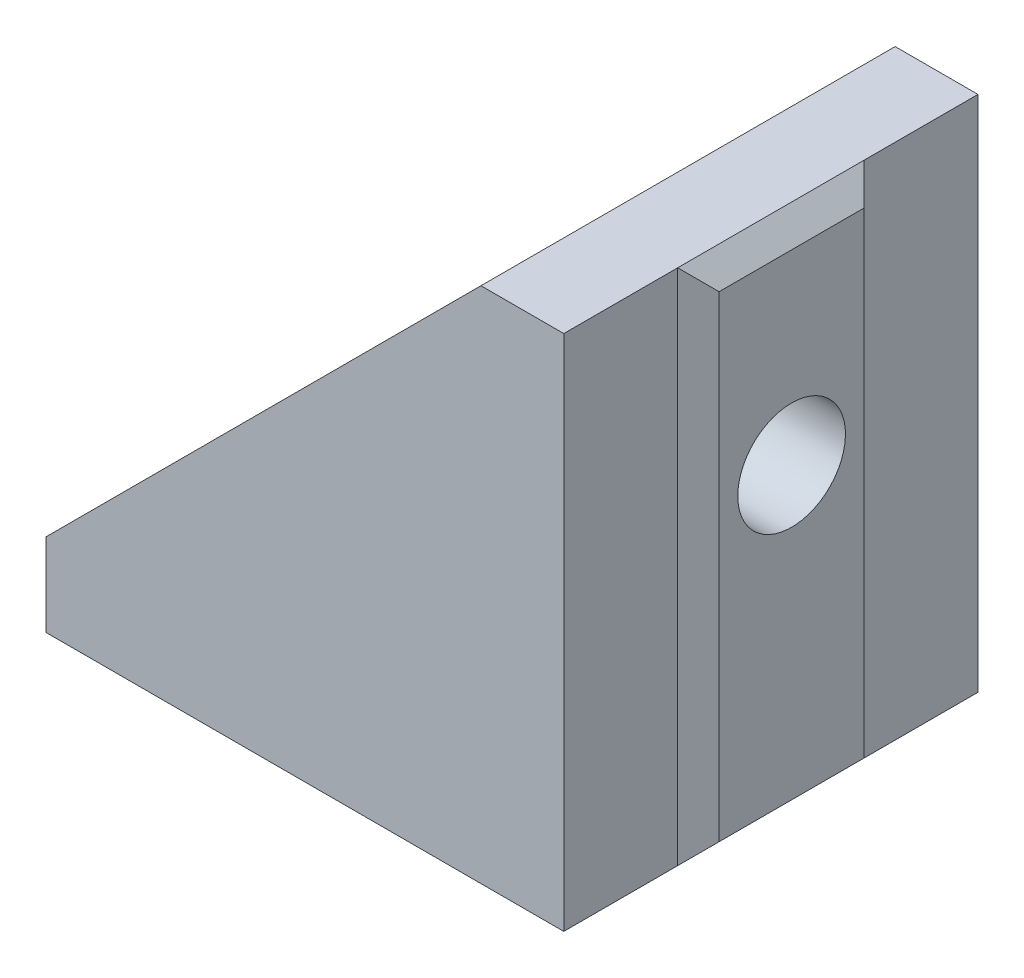
ISO-10303-21;
HEADER;
FILE_DESCRIPTION(('STEP AP214'),'2;1');
FILE_NAME('part.step','',(''),(''),'','','');
FILE_SCHEMA(('AUTOMOTIVE_DESIGN { 1 0 10303 214 1 1 1 1 }'));
ENDSEC;
DATA;
#1=APPLICATION_CONTEXT('core data for automotive mechanical design processes');
#2=APPLICATION_PROTOCOL_DEFINITION('international standard','automotive_design',2000,#1);
#3=PRODUCT_CONTEXT('',#1,'mechanical');
#4=PRODUCT('Part','Part','',(#3));
#5=PRODUCT_RELATED_PRODUCT_CATEGORY('part','',(#4));
#6=PRODUCT_DEFINITION_FORMATION('','',#4);
#7=PRODUCT_DEFINITION_CONTEXT('part definition',#1,'design');
#8=PRODUCT_DEFINITION('design','',#6,#7);
#9=PRODUCT_DEFINITION_SHAPE('','',#8);
#10=(LENGTH_UNIT() NAMED_UNIT(*) SI_UNIT(.MILLI.,.METRE.));
#11=(NAMED_UNIT(*) PLANE_ANGLE_UNIT() SI_UNIT($,.RADIAN.));
#12=(NAMED_UNIT(*) SI_UNIT($,.STERADIAN.) SOLID_ANGLE_UNIT());
#13=UNCERTAINTY_MEASURE_WITH_UNIT(LENGTH_MEASURE(1.E-05),#10,'distance_accuracy_value','');
#14=(GEOMETRIC_REPRESENTATION_CONTEXT(3) GLOBAL_UNCERTAINTY_ASSIGNED_CONTEXT((#13)) GLOBAL_UNIT_ASSIGNED_CONTEXT((#10,
#11,#12)) REPRESENTATION_CONTEXT('',''));
#15=CARTESIAN_POINT('',(0.,0.,0.));
#16=DIRECTION('',(0.,0.,1.));
#17=DIRECTION('',(1.,0.,0.));
#18=AXIS2_PLACEMENT_3D('',#15,#16,#17);
#19=CARTESIAN_POINT('',(25.0000000000001,0.,20.));
#20=DIRECTION('',(0.,1.,0.));
#21=DIRECTION('',(0.,0.,1.));
#22=AXIS2_PLACEMENT_3D('',#19,#20,#21);
#23=PLANE('',#22);
#24=DIRECTION('',(1.,0.,0.));
#25=VECTOR('',#24,1.);
#26=CARTESIAN_POINT('',(25.0000000000001,0.,5.5));
#27=LINE('',#26,#25);
#28=CARTESIAN_POINT('',(0.,0.,5.5));
#29=VERTEX_POINT('',#28);
#30=CARTESIAN_POINT('',(25.0000000000001,0.,5.5));
#31=VERTEX_POINT('',#30);
#32=EDGE_CURVE('E254',#29,#31,#27,.T.);
#33=ORIENTED_EDGE('',*,*,#32,.F.);
#34=DIRECTION('',(0.,0.,-1.));
#35=VECTOR('',#34,1.);
#36=CARTESIAN_POINT('',(0.,0.,20.));
#37=LINE('',#36,#35);
#38=CARTESIAN_POINT('',(0.,0.,0.));
#39=VERTEX_POINT('',#38);
#40=EDGE_CURVE('E321',#29,#39,#37,.T.);
#41=ORIENTED_EDGE('',*,*,#40,.T.);
#42=DIRECTION('',(1.,0.,0.));
#43=VECTOR('',#42,1.);
#44=CARTESIAN_POINT('',(25.0000000000001,0.,0.));
#45=LINE('',#44,#43);
#46=CARTESIAN_POINT('',(25.0000000000001,0.,0.));
#47=VERTEX_POINT('',#46);
#48=EDGE_CURVE('E291',#39,#47,#45,.T.);
#49=ORIENTED_EDGE('',*,*,#48,.T.);
#50=DIRECTION('',(0.,0.,-1.));
#51=VECTOR('',#50,1.);
#52=CARTESIAN_POINT('',(25.0000000000001,0.,20.));
#53=LINE('',#52,#51);
#54=EDGE_CURVE('E345',#31,#47,#53,.T.);
#55=ORIENTED_EDGE('',*,*,#54,.F.);
#56=EDGE_LOOP('',(#33,#41,#49,#55));
#57=FACE_BOUND('',#56,.T.);
#58=ADVANCED_FACE('F33',(#57),#23,.F.);
#59=DIRECTION('',(-1.,0.,0.));
#60=VECTOR('',#59,1.);
#61=CARTESIAN_POINT('',(25.0000000000001,0.,14.5));
#62=LINE('',#61,#60);
#63=CARTESIAN_POINT('',(25.0000000000001,0.,14.5));
#64=VERTEX_POINT('',#63);
#65=CARTESIAN_POINT('',(0.,0.,14.5));
#66=VERTEX_POINT('',#65);
#67=EDGE_CURVE('E238',#64,#66,#62,.T.);
#68=ORIENTED_EDGE('',*,*,#67,.F.);
#69=CARTESIAN_POINT('',(25.0000000000001,0.,20.));
#70=VERTEX_POINT('',#69);
#71=EDGE_CURVE('E346',#70,#64,#53,.T.);
#72=ORIENTED_EDGE('',*,*,#71,.F.);
#73=DIRECTION('',(1.,0.,0.));
#74=VECTOR('',#73,1.);
#75=CARTESIAN_POINT('',(25.0000000000001,0.,20.));
#76=LINE('',#75,#74);
#77=CARTESIAN_POINT('',(0.,0.,20.));
#78=VERTEX_POINT('',#77);
#79=EDGE_CURVE('E309',#78,#70,#76,.T.);
#80=ORIENTED_EDGE('',*,*,#79,.F.);
#81=EDGE_CURVE('E333',#78,#66,#37,.T.);
#82=ORIENTED_EDGE('',*,*,#81,.T.);
#83=EDGE_LOOP('',(#68,#72,#80,#82));
#84=FACE_BOUND('',#83,.T.);
#85=ADVANCED_FACE('F457',(#84),#23,.F.);
#86=CARTESIAN_POINT('',(25.0000000000001,25.,20.));
#87=DIRECTION('',(-1.,0.,0.));
#88=DIRECTION('',(0.,-1.,0.));
#89=AXIS2_PLACEMENT_3D('',#86,#87,#88);
#90=PLANE('',#89);
#91=DIRECTION('',(0.,-1.,0.));
#92=VECTOR('',#91,1.);
#93=CARTESIAN_POINT('',(25.0000000000001,25.,14.5));
#94=LINE('',#93,#92);
#95=CARTESIAN_POINT('',(25.0000000000001,25.,14.5));
#96=VERTEX_POINT('',#95);
#97=EDGE_CURVE('E261',#96,#64,#94,.T.);
#98=ORIENTED_EDGE('',*,*,#97,.F.);
#99=DIRECTION('',(0.,0.,-1.));
#100=VECTOR('',#99,1.);
#101=CARTESIAN_POINT('',(25.0000000000001,25.,20.));
#102=LINE('',#101,#100);
#103=CARTESIAN_POINT('',(25.0000000000001,25.,20.));
#104=VERTEX_POINT('',#103);
#105=EDGE_CURVE('E342',#104,#96,#102,.T.);
#106=ORIENTED_EDGE('',*,*,#105,.F.);
#107=DIRECTION('',(0.,1.,0.));
#108=VECTOR('',#107,1.);
#109=CARTESIAN_POINT('',(25.0000000000001,25.,20.));
#110=LINE('',#109,#108);
#111=EDGE_CURVE('E312',#70,#104,#110,.T.);
#112=ORIENTED_EDGE('',*,*,#111,.F.);
#113=ORIENTED_EDGE('',*,*,#71,.T.);
#114=EDGE_LOOP('',(#98,#106,#112,#113));
#115=FACE_BOUND('',#114,.T.);
#116=ADVANCED_FACE('F455',(#115),#90,.F.);
#117=DIRECTION('',(0.,1.,0.));
#118=VECTOR('',#117,1.);
#119=CARTESIAN_POINT('',(25.0000000000001,25.,5.5));
#120=LINE('',#119,#118);
#121=CARTESIAN_POINT('',(25.0000000000001,25.,5.5));
#122=VERTEX_POINT('',#121);
#123=EDGE_CURVE('E281',#31,#122,#120,.T.);
#124=ORIENTED_EDGE('',*,*,#123,.F.);
#125=ORIENTED_EDGE('',*,*,#54,.T.);
#126=DIRECTION('',(0.,1.,0.));
#127=VECTOR('',#126,1.);
#128=CARTESIAN_POINT('',(25.0000000000001,25.,0.));
#129=LINE('',#128,#127);
#130=CARTESIAN_POINT('',(25.0000000000001,25.,0.));
#131=VERTEX_POINT('',#130);
#132=EDGE_CURVE('E324',#47,#131,#129,.T.);
#133=ORIENTED_EDGE('',*,*,#132,.T.);
#134=EDGE_CURVE('E341',#122,#131,#102,.T.);
#135=ORIENTED_EDGE('',*,*,#134,.F.);
#136=EDGE_LOOP('',(#124,#125,#133,#135));
#137=FACE_BOUND('',#136,.T.);
#138=ADVANCED_FACE('F436',(#137),#90,.F.);
#139=CARTESIAN_POINT('',(21.0000000000001,25.,20.));
#140=DIRECTION('',(0.,-1.,0.));
#141=DIRECTION('',(0.,0.,-1.));
#142=AXIS2_PLACEMENT_3D('',#139,#140,#141);
#143=PLANE('',#142);
#144=DIRECTION('',(-1.,0.,0.));
#145=VECTOR('',#144,1.);
#146=CARTESIAN_POINT('',(21.0000000000001,25.,0.));
#147=LINE('',#146,#145);
#148=CARTESIAN_POINT('',(21.0000000000001,25.,0.));
#149=VERTEX_POINT('',#148);
#150=EDGE_CURVE('E327',#131,#149,#147,.T.);
#151=ORIENTED_EDGE('',*,*,#150,.T.);
#152=DIRECTION('',(0.,0.,-1.));
#153=VECTOR('',#152,1.);
#154=CARTESIAN_POINT('',(21.0000000000001,25.,20.));
#155=LINE('',#154,#153);
#156=CARTESIAN_POINT('',(21.0000000000001,25.,20.));
#157=VERTEX_POINT('',#156);
#158=EDGE_CURVE('E338',#157,#149,#155,.T.);
#159=ORIENTED_EDGE('',*,*,#158,.F.);
#160=DIRECTION('',(-1.,0.,0.));
#161=VECTOR('',#160,1.);
#162=CARTESIAN_POINT('',(21.0000000000001,25.,20.));
#163=LINE('',#162,#161);
#164=EDGE_CURVE('E315',#104,#157,#163,.T.);
#165=ORIENTED_EDGE('',*,*,#164,.F.);
#166=ORIENTED_EDGE('',*,*,#105,.T.);
#167=DIRECTION('',(0.,0.,1.));
#168=VECTOR('',#167,1.);
#169=CARTESIAN_POINT('',(25.0000000000001,25.,14.5));
#170=LINE('',#169,#168);
#171=EDGE_CURVE('E284',#122,#96,#170,.T.);
#172=ORIENTED_EDGE('',*,*,#171,.F.);
#173=ORIENTED_EDGE('',*,*,#134,.T.);
#174=EDGE_LOOP('',(#151,#159,#165,#166,#172,#173));
#175=FACE_BOUND('',#174,.T.);
#176=ADVANCED_FACE('F432',(#175),#143,.F.);
#177=CARTESIAN_POINT('',(0.,4.,20.));
#178=DIRECTION('',(0.707106781186546,-0.707106781186549,0.));
#179=DIRECTION('',(0.707106781186549,0.707106781186546,0.));
#180=AXIS2_PLACEMENT_3D('',#177,#178,#179);
#181=PLANE('',#180);
#182=DIRECTION('',(0.,0.,1.));
#183=VECTOR('',#182,1.);
#184=CARTESIAN_POINT('',(2.4738023329125,6.47380233291249,7.50000000000002));
#185=LINE('',#184,#183);
#186=CARTESIAN_POINT('',(2.4738023329125,6.47380233291249,7.50000000000002));
#187=VERTEX_POINT('',#186);
#188=CARTESIAN_POINT('',(2.4738023329125,6.47380233291249,12.5));
#189=VERTEX_POINT('',#188);
#190=EDGE_CURVE('E222',#187,#189,#185,.T.);
#191=ORIENTED_EDGE('',*,*,#190,.F.);
#192=CARTESIAN_POINT('',(4.24156928587887,8.24156928587886,7.5));
#193=DIRECTION('',(-0.707106781186546,0.707106781186549,0.));
#194=DIRECTION('',(-0.707106781186549,-0.707106781186546,0.));
#195=AXIS2_PLACEMENT_3D('',#192,#193,#194);
#196=CIRCLE('',#195,2.5);
#197=CARTESIAN_POINT('',(4.24156928587888,8.24156928587887,5.));
#198=VERTEX_POINT('',#197);
#199=EDGE_CURVE('E203',#198,#187,#196,.T.);
#200=ORIENTED_EDGE('',*,*,#199,.F.);
#201=DIRECTION('',(-0.707106781186549,-0.707106781186546,0.));
#202=VECTOR('',#201,1.);
#203=CARTESIAN_POINT('',(16.7573593128808,20.7573593128807,5.));
#204=LINE('',#203,#202);
#205=CARTESIAN_POINT('',(16.7573593128808,20.7573593128807,5.));
#206=VERTEX_POINT('',#205);
#207=EDGE_CURVE('E212',#206,#198,#204,.T.);
#208=ORIENTED_EDGE('',*,*,#207,.F.);
#209=CARTESIAN_POINT('',(16.7573593128808,20.7573593128807,7.5));
#210=DIRECTION('',(-0.707106781186546,0.707106781186549,0.));
#211=DIRECTION('',(0.707106781186549,0.707106781186546,0.));
#212=AXIS2_PLACEMENT_3D('',#209,#210,#211);
#213=CIRCLE('',#212,2.5);
#214=CARTESIAN_POINT('',(18.5251262658472,22.5251262658471,7.5));
#215=VERTEX_POINT('',#214);
#216=EDGE_CURVE('E216',#215,#206,#213,.T.);
#217=ORIENTED_EDGE('',*,*,#216,.F.);
#218=DIRECTION('',(0.,0.,-1.));
#219=VECTOR('',#218,1.);
#220=CARTESIAN_POINT('',(18.5251262658472,22.5251262658471,7.50000000000002));
#221=LINE('',#220,#219);
#222=CARTESIAN_POINT('',(18.5251262658472,22.5251262658471,12.5));
#223=VERTEX_POINT('',#222);
#224=EDGE_CURVE('E232',#223,#215,#221,.T.);
#225=ORIENTED_EDGE('',*,*,#224,.F.);
#226=CARTESIAN_POINT('',(16.7573593128808,20.7573593128807,12.5));
#227=DIRECTION('',(-0.707106781186546,0.707106781186549,0.));
#228=DIRECTION('',(-0.707106781186549,-0.707106781186546,0.));
#229=AXIS2_PLACEMENT_3D('',#226,#227,#228);
#230=CIRCLE('',#229,2.5);
#231=CARTESIAN_POINT('',(16.7573593128808,20.7573593128807,15.));
#232=VERTEX_POINT('',#231);
#233=EDGE_CURVE('E229',#232,#223,#230,.T.);
#234=ORIENTED_EDGE('',*,*,#233,.F.);
#235=DIRECTION('',(0.707106781186549,0.707106781186546,0.));
#236=VECTOR('',#235,1.);
#237=CARTESIAN_POINT('',(16.7573593128808,20.7573593128807,15.));
#238=LINE('',#237,#236);
#239=CARTESIAN_POINT('',(4.24156928587888,8.24156928587887,15.));
#240=VERTEX_POINT('',#239);
#241=EDGE_CURVE('E227',#240,#232,#238,.T.);
#242=ORIENTED_EDGE('',*,*,#241,.F.);
#243=CARTESIAN_POINT('',(4.24156928587887,8.24156928587886,12.5));
#244=DIRECTION('',(-0.707106781186546,0.707106781186549,0.));
#245=DIRECTION('',(-0.707106781186549,-0.707106781186546,0.));
#246=AXIS2_PLACEMENT_3D('',#243,#244,#245);
#247=CIRCLE('',#246,2.5);
#248=EDGE_CURVE('E224',#189,#240,#247,.T.);
#249=ORIENTED_EDGE('',*,*,#248,.F.);
#250=EDGE_LOOP('',(#191,#200,#208,#217,#225,#234,#242,#249));
#251=FACE_BOUND('',#250,.T.);
#252=DIRECTION('',(-0.707106781186549,-0.707106781186546,0.));
#253=VECTOR('',#252,1.);
#254=CARTESIAN_POINT('',(0.,4.,0.));
#255=LINE('',#254,#253);
#256=CARTESIAN_POINT('',(0.,4.,0.));
#257=VERTEX_POINT('',#256);
#258=EDGE_CURVE('E329',#149,#257,#255,.T.);
#259=ORIENTED_EDGE('',*,*,#258,.T.);
#260=DIRECTION('',(0.,0.,-1.));
#261=VECTOR('',#260,1.);
#262=CARTESIAN_POINT('',(0.,4.,20.));
#263=LINE('',#262,#261);
#264=CARTESIAN_POINT('',(0.,4.,20.));
#265=VERTEX_POINT('',#264);
#266=EDGE_CURVE('E335',#265,#257,#263,.T.);
#267=ORIENTED_EDGE('',*,*,#266,.F.);
#268=DIRECTION('',(-0.707106781186549,-0.707106781186546,0.));
#269=VECTOR('',#268,1.);
#270=CARTESIAN_POINT('',(0.,4.,20.));
#271=LINE('',#270,#269);
#272=EDGE_CURVE('E317',#157,#265,#271,.T.);
#273=ORIENTED_EDGE('',*,*,#272,.F.);
#274=ORIENTED_EDGE('',*,*,#158,.T.);
#275=EDGE_LOOP('',(#259,#267,#273,#274));
#276=FACE_BOUND('',#275,.T.);
#277=ADVANCED_FACE('F380',(#251,#276),#181,.F.);
#278=CARTESIAN_POINT('',(0.,0.,20.));
#279=DIRECTION('',(1.,0.,0.));
#280=DIRECTION('',(0.,0.,-1.));
#281=AXIS2_PLACEMENT_3D('',#278,#279,#280);
#282=PLANE('',#281);
#283=DIRECTION('',(0.,-1.,0.));
#284=VECTOR('',#283,1.);
#285=CARTESIAN_POINT('',(0.,0.,0.));
#286=LINE('',#285,#284);
#287=EDGE_CURVE('E313',#257,#39,#286,.T.);
#288=ORIENTED_EDGE('',*,*,#287,.T.);
#289=ORIENTED_EDGE('',*,*,#40,.F.);
#290=DIRECTION('',(0.,0.,-1.));
#291=VECTOR('',#290,1.);
#292=CARTESIAN_POINT('',(0.,0.,14.5));
#293=LINE('',#292,#291);
#294=EDGE_CURVE('E251',#66,#29,#293,.T.);
#295=ORIENTED_EDGE('',*,*,#294,.F.);
#296=ORIENTED_EDGE('',*,*,#81,.F.);
#297=DIRECTION('',(0.,-1.,0.));
#298=VECTOR('',#297,1.);
#299=CARTESIAN_POINT('',(0.,0.,20.));
#300=LINE('',#299,#298);
#301=EDGE_CURVE('E319',#265,#78,#300,.T.);
#302=ORIENTED_EDGE('',*,*,#301,.F.);
#303=ORIENTED_EDGE('',*,*,#266,.T.);
#304=EDGE_LOOP('',(#288,#289,#295,#296,#302,#303));
#305=FACE_BOUND('',#304,.T.);
#306=ADVANCED_FACE('F473',(#305),#282,.F.);
#307=CARTESIAN_POINT('',(0.,0.,20.));
#308=DIRECTION('',(0.,0.,-1.));
#309=DIRECTION('',(-1.,0.,0.));
#310=AXIS2_PLACEMENT_3D('',#307,#308,#309);
#311=PLANE('',#310);
#312=ORIENTED_EDGE('',*,*,#79,.T.);
#313=ORIENTED_EDGE('',*,*,#111,.T.);
#314=ORIENTED_EDGE('',*,*,#164,.T.);
#315=ORIENTED_EDGE('',*,*,#272,.T.);
#316=ORIENTED_EDGE('',*,*,#301,.T.);
#317=EDGE_LOOP('',(#312,#313,#314,#315,#316));
#318=FACE_BOUND('',#317,.T.);
#319=ADVANCED_FACE('F450',(#318),#311,.F.);
#320=CARTESIAN_POINT('',(0.,0.,0.));
#321=DIRECTION('',(0.,0.,-1.));
#322=DIRECTION('',(-1.,0.,0.));
#323=AXIS2_PLACEMENT_3D('',#320,#321,#322);
#324=PLANE('',#323);
#325=ORIENTED_EDGE('',*,*,#48,.F.);
#326=ORIENTED_EDGE('',*,*,#287,.F.);
#327=ORIENTED_EDGE('',*,*,#258,.F.);
#328=ORIENTED_EDGE('',*,*,#150,.F.);
#329=ORIENTED_EDGE('',*,*,#132,.F.);
#330=EDGE_LOOP('',(#325,#326,#327,#328,#329));
#331=FACE_BOUND('',#330,.T.);
#332=ADVANCED_FACE('F443',(#331),#324,.T.);
#333=CARTESIAN_POINT('',(25.0000000000001,25.,14.5));
#334=DIRECTION('',(0.707106781186549,0.,0.707106781186546));
#335=DIRECTION('',(0.707106781186546,0.,-0.707106781186549));
#336=AXIS2_PLACEMENT_3D('',#333,#334,#335);
#337=PLANE('',#336);
#338=ORIENTED_EDGE('',*,*,#97,.T.);
#339=DIRECTION('',(-0.577350269189624,-0.577350269189627,0.577350269189626));
#340=VECTOR('',#339,1.);
#341=CARTESIAN_POINT('',(25.0000000000001,0.,14.5));
#342=LINE('',#341,#340);
#343=CARTESIAN_POINT('',(26.0000000000001,1.00000000000001,13.5));
#344=VERTEX_POINT('',#343);
#345=EDGE_CURVE('E288',#344,#64,#342,.T.);
#346=ORIENTED_EDGE('',*,*,#345,.F.);
#347=DIRECTION('',(0.,1.,0.));
#348=VECTOR('',#347,1.);
#349=CARTESIAN_POINT('',(26.0000000000001,25.,13.5));
#350=LINE('',#349,#348);
#351=CARTESIAN_POINT('',(26.0000000000001,24.,13.5));
#352=VERTEX_POINT('',#351);
#353=EDGE_CURVE('E287',#352,#344,#350,.F.);
#354=ORIENTED_EDGE('',*,*,#353,.F.);
#355=DIRECTION('',(-0.577350269189625,0.577350269189626,0.577350269189627));
#356=VECTOR('',#355,1.);
#357=CARTESIAN_POINT('',(25.0000000000001,25.,14.5));
#358=LINE('',#357,#356);
#359=EDGE_CURVE('E293',#352,#96,#358,.T.);
#360=ORIENTED_EDGE('',*,*,#359,.T.);
#361=EDGE_LOOP('',(#338,#346,#354,#360));
#362=FACE_BOUND('',#361,.T.);
#363=ADVANCED_FACE('F419',(#362),#337,.T.);
#364=CARTESIAN_POINT('',(25.0000000000001,0.,14.5));
#365=DIRECTION('',(0.707106781186549,-0.707106781186546,0.));
#366=DIRECTION('',(0.707106781186546,0.707106781186549,0.));
#367=AXIS2_PLACEMENT_3D('',#364,#365,#366);
#368=PLANE('',#367);
#369=ORIENTED_EDGE('',*,*,#345,.T.);
#370=DIRECTION('',(0.577350269189626,0.577350269189624,0.577350269189627));
#371=VECTOR('',#370,1.);
#372=CARTESIAN_POINT('',(25.0000000000001,0.,14.5));
#373=LINE('',#372,#371);
#374=CARTESIAN_POINT('',(24.0000000000001,-1.,13.5));
#375=VERTEX_POINT('',#374);
#376=EDGE_CURVE('E258',#375,#64,#373,.T.);
#377=ORIENTED_EDGE('',*,*,#376,.F.);
#378=DIRECTION('',(0.,0.,-1.));
#379=VECTOR('',#378,1.);
#380=CARTESIAN_POINT('',(24.0000000000001,-1.,0.));
#381=LINE('',#380,#379);
#382=CARTESIAN_POINT('',(24.0000000000001,-1.,6.5));
#383=VERTEX_POINT('',#382);
#384=EDGE_CURVE('E257',#383,#375,#381,.F.);
#385=ORIENTED_EDGE('',*,*,#384,.F.);
#386=DIRECTION('',(0.577350269189626,0.577350269189624,-0.577350269189627));
#387=VECTOR('',#386,1.);
#388=CARTESIAN_POINT('',(22.0000000000001,-3.,8.50000000000001));
#389=LINE('',#388,#387);
#390=EDGE_CURVE('E263',#383,#31,#389,.T.);
#391=ORIENTED_EDGE('',*,*,#390,.T.);
#392=DIRECTION('',(-0.577350269189624,-0.577350269189627,-0.577350269189627));
#393=VECTOR('',#392,1.);
#394=CARTESIAN_POINT('',(33.3333333333334,8.33333333333336,13.8333333333334));
#395=LINE('',#394,#393);
#396=CARTESIAN_POINT('',(26.0000000000001,1.00000000000001,6.5));
#397=VERTEX_POINT('',#396);
#398=EDGE_CURVE('E292',#397,#31,#395,.T.);
#399=ORIENTED_EDGE('',*,*,#398,.F.);
#400=DIRECTION('',(0.,0.,1.));
#401=VECTOR('',#400,1.);
#402=CARTESIAN_POINT('',(26.0000000000001,1.00000000000001,14.5));
#403=LINE('',#402,#401);
#404=EDGE_CURVE('E304',#344,#397,#403,.F.);
#405=ORIENTED_EDGE('',*,*,#404,.F.);
#406=EDGE_LOOP('',(#369,#377,#385,#391,#399,#405));
#407=FACE_BOUND('',#406,.T.);
#408=ADVANCED_FACE('F422',(#407),#368,.T.);
#409=CARTESIAN_POINT('',(25.0000000000001,25.,5.5));
#410=DIRECTION('',(0.707106781186549,0.,-0.707106781186546));
#411=DIRECTION('',(-0.707106781186546,0.,-0.707106781186549));
#412=AXIS2_PLACEMENT_3D('',#409,#410,#411);
#413=PLANE('',#412);
#414=ORIENTED_EDGE('',*,*,#123,.T.);
#415=DIRECTION('',(-0.577350269189625,0.577350269189626,-0.577350269189627));
#416=VECTOR('',#415,1.);
#417=CARTESIAN_POINT('',(28.0000000000001,22.,8.50000000000001));
#418=LINE('',#417,#416);
#419=CARTESIAN_POINT('',(26.0000000000001,24.,6.50000000000001));
#420=VERTEX_POINT('',#419);
#421=EDGE_CURVE('E296',#420,#122,#418,.T.);
#422=ORIENTED_EDGE('',*,*,#421,.F.);
#423=DIRECTION('',(0.,-1.,0.));
#424=VECTOR('',#423,1.);
#425=CARTESIAN_POINT('',(26.0000000000001,25.,6.50000000000001));
#426=LINE('',#425,#424);
#427=EDGE_CURVE('E306',#397,#420,#426,.F.);
#428=ORIENTED_EDGE('',*,*,#427,.F.);
#429=ORIENTED_EDGE('',*,*,#398,.T.);
#430=EDGE_LOOP('',(#414,#422,#428,#429));
#431=FACE_BOUND('',#430,.T.);
#432=ADVANCED_FACE('F428',(#431),#413,.T.);
#433=CARTESIAN_POINT('',(25.0000000000001,25.,14.5));
#434=DIRECTION('',(0.707106781186548,0.707106781186547,0.));
#435=DIRECTION('',(-0.707106781186547,0.707106781186548,0.));
#436=AXIS2_PLACEMENT_3D('',#433,#434,#435);
#437=PLANE('',#436);
#438=ORIENTED_EDGE('',*,*,#171,.T.);
#439=ORIENTED_EDGE('',*,*,#359,.F.);
#440=DIRECTION('',(0.,0.,-1.));
#441=VECTOR('',#440,1.);
#442=CARTESIAN_POINT('',(26.0000000000001,24.,14.5));
#443=LINE('',#442,#441);
#444=EDGE_CURVE('E297',#420,#352,#443,.F.);
#445=ORIENTED_EDGE('',*,*,#444,.F.);
#446=ORIENTED_EDGE('',*,*,#421,.T.);
#447=EDGE_LOOP('',(#438,#439,#445,#446));
#448=FACE_BOUND('',#447,.T.);
#449=ADVANCED_FACE('F411',(#448),#437,.T.);
#450=CARTESIAN_POINT('',(26.0000000000001,0.,0.));
#451=DIRECTION('',(1.,0.,0.));
#452=DIRECTION('',(0.,1.,0.));
#453=AXIS2_PLACEMENT_3D('',#450,#451,#452);
#454=PLANE('',#453);
#455=CARTESIAN_POINT('',(26.0000000000001,15.,10.));
#456=DIRECTION('',(1.,0.,0.));
#457=DIRECTION('',(0.,1.,0.));
#458=AXIS2_PLACEMENT_3D('',#455,#456,#457);
#459=CIRCLE('',#458,2.6);
#460=CARTESIAN_POINT('',(26.0000000000001,17.6,10.));
#461=VERTEX_POINT('',#460);
#462=EDGE_CURVE('E397',#461,#461,#459,.T.);
#463=ORIENTED_EDGE('',*,*,#462,.F.);
#464=EDGE_LOOP('',(#463));
#465=FACE_BOUND('',#464,.T.);
#466=ORIENTED_EDGE('',*,*,#353,.T.);
#467=ORIENTED_EDGE('',*,*,#404,.T.);
#468=ORIENTED_EDGE('',*,*,#427,.T.);
#469=ORIENTED_EDGE('',*,*,#444,.T.);
#470=EDGE_LOOP('',(#466,#467,#468,#469));
#471=FACE_BOUND('',#470,.T.);
#472=ADVANCED_FACE('F407',(#465,#471),#454,.T.);
#473=CARTESIAN_POINT('',(25.0000000000001,0.,14.5));
#474=DIRECTION('',(0.,-0.707106781186549,0.707106781186546));
#475=DIRECTION('',(0.,-0.707106781186546,-0.707106781186549));
#476=AXIS2_PLACEMENT_3D('',#473,#474,#475);
#477=PLANE('',#476);
#478=ORIENTED_EDGE('',*,*,#67,.T.);
#479=DIRECTION('',(-0.577350269189626,0.577350269189624,0.577350269189627));
#480=VECTOR('',#479,1.);
#481=CARTESIAN_POINT('',(0.,0.,14.5));
#482=LINE('',#481,#480);
#483=CARTESIAN_POINT('',(1.,-1.,13.5));
#484=VERTEX_POINT('',#483);
#485=EDGE_CURVE('E262',#484,#66,#482,.T.);
#486=ORIENTED_EDGE('',*,*,#485,.F.);
#487=DIRECTION('',(1.,0.,0.));
#488=VECTOR('',#487,1.);
#489=CARTESIAN_POINT('',(0.,-1.,13.5));
#490=LINE('',#489,#488);
#491=EDGE_CURVE('E274',#375,#484,#490,.F.);
#492=ORIENTED_EDGE('',*,*,#491,.F.);
#493=ORIENTED_EDGE('',*,*,#376,.T.);
#494=EDGE_LOOP('',(#478,#486,#492,#493));
#495=FACE_BOUND('',#494,.T.);
#496=ADVANCED_FACE('F410',(#495),#477,.T.);
#497=CARTESIAN_POINT('',(0.,0.,14.5));
#498=DIRECTION('',(-0.707106781186546,-0.707106781186549,0.));
#499=DIRECTION('',(0.707106781186549,-0.707106781186546,0.));
#500=AXIS2_PLACEMENT_3D('',#497,#498,#499);
#501=PLANE('',#500);
#502=ORIENTED_EDGE('',*,*,#294,.T.);
#503=DIRECTION('',(-0.577350269189626,0.577350269189624,-0.577350269189627));
#504=VECTOR('',#503,1.);
#505=CARTESIAN_POINT('',(8.33333333333338,-8.33333333333335,13.8333333333334));
#506=LINE('',#505,#504);
#507=CARTESIAN_POINT('',(1.,-1.,6.5));
#508=VERTEX_POINT('',#507);
#509=EDGE_CURVE('E266',#508,#29,#506,.T.);
#510=ORIENTED_EDGE('',*,*,#509,.F.);
#511=DIRECTION('',(0.,0.,1.));
#512=VECTOR('',#511,1.);
#513=CARTESIAN_POINT('',(1.,-1.,0.));
#514=LINE('',#513,#512);
#515=EDGE_CURVE('E276',#484,#508,#514,.F.);
#516=ORIENTED_EDGE('',*,*,#515,.F.);
#517=ORIENTED_EDGE('',*,*,#485,.T.);
#518=EDGE_LOOP('',(#502,#510,#516,#517));
#519=FACE_BOUND('',#518,.T.);
#520=ADVANCED_FACE('F463',(#519),#501,.T.);
#521=CARTESIAN_POINT('',(25.0000000000001,0.,5.5));
#522=DIRECTION('',(0.,-0.707106781186549,-0.707106781186546));
#523=DIRECTION('',(0.,0.707106781186546,-0.707106781186549));
#524=AXIS2_PLACEMENT_3D('',#521,#522,#523);
#525=PLANE('',#524);
#526=ORIENTED_EDGE('',*,*,#32,.T.);
#527=ORIENTED_EDGE('',*,*,#390,.F.);
#528=DIRECTION('',(-1.,0.,0.));
#529=VECTOR('',#528,1.);
#530=CARTESIAN_POINT('',(0.,-1.,6.5));
#531=LINE('',#530,#529);
#532=EDGE_CURVE('E267',#508,#383,#531,.F.);
#533=ORIENTED_EDGE('',*,*,#532,.F.);
#534=ORIENTED_EDGE('',*,*,#509,.T.);
#535=EDGE_LOOP('',(#526,#527,#533,#534));
#536=FACE_BOUND('',#535,.T.);
#537=ADVANCED_FACE('F469',(#536),#525,.T.);
#538=CARTESIAN_POINT('',(0.,-1.,0.));
#539=DIRECTION('',(0.,1.,0.));
#540=DIRECTION('',(0.,0.,1.));
#541=AXIS2_PLACEMENT_3D('',#538,#539,#540);
#542=PLANE('',#541);
#543=CARTESIAN_POINT('',(9.,-1.,9.99999999999999));
#544=DIRECTION('',(0.,-1.,0.));
#545=DIRECTION('',(0.,0.,-1.));
#546=AXIS2_PLACEMENT_3D('',#543,#544,#545);
#547=CIRCLE('',#546,2.6);
#548=CARTESIAN_POINT('',(9.,-1.,7.4));
#549=VERTEX_POINT('',#548);
#550=EDGE_CURVE('E391',#549,#549,#547,.T.);
#551=ORIENTED_EDGE('',*,*,#550,.F.);
#552=EDGE_LOOP('',(#551));
#553=FACE_BOUND('',#552,.T.);
#554=ORIENTED_EDGE('',*,*,#384,.T.);
#555=ORIENTED_EDGE('',*,*,#491,.T.);
#556=ORIENTED_EDGE('',*,*,#515,.T.);
#557=ORIENTED_EDGE('',*,*,#532,.T.);
#558=EDGE_LOOP('',(#554,#555,#556,#557));
#559=FACE_BOUND('',#558,.T.);
#560=ADVANCED_FACE('F467',(#553,#559),#542,.F.);
#561=CARTESIAN_POINT('',(6.71644302003178,5.76669555172594,7.5));
#562=DIRECTION('',(-0.707106781186546,0.707106781186549,0.));
#563=DIRECTION('',(-0.707106781186549,-0.707106781186546,0.));
#564=AXIS2_PLACEMENT_3D('',#561,#562,#563);
#565=CYLINDRICAL_SURFACE('',#564,2.5);
#566=ORIENTED_EDGE('',*,*,#199,.T.);
#567=DIRECTION('',(-0.707106781186546,0.707106781186549,0.));
#568=VECTOR('',#567,1.);
#569=CARTESIAN_POINT('',(4.94867606706541,3.99892859875957,7.50000000000002));
#570=LINE('',#569,#568);
#571=CARTESIAN_POINT('',(4.94867606706541,3.99892859875957,7.50000000000002));
#572=VERTEX_POINT('',#571);
#573=EDGE_CURVE('E200',#572,#187,#570,.T.);
#574=ORIENTED_EDGE('',*,*,#573,.F.);
#575=CARTESIAN_POINT('',(8.4842099729982,3.99892859875951,7.5));
#576=DIRECTION('',(0.,1.,0.));
#577=DIRECTION('',(-1.,0.,0.));
#578=AXIS2_PLACEMENT_3D('',#575,#576,#577);
#579=ELLIPSE('',#578,3.53553390593276,2.5);
#580=CARTESIAN_POINT('',(8.48420997299823,3.99892859875951,5.));
#581=VERTEX_POINT('',#580);
#582=EDGE_CURVE('E188',#572,#581,#579,.F.);
#583=ORIENTED_EDGE('',*,*,#582,.T.);
#584=DIRECTION('',(-0.707106781186546,0.707106781186549,0.));
#585=VECTOR('',#584,1.);
#586=CARTESIAN_POINT('',(6.71644302003179,5.76669555172595,5.));
#587=LINE('',#586,#585);
#588=EDGE_CURVE('E73',#581,#198,#587,.T.);
#589=ORIENTED_EDGE('',*,*,#588,.T.);
#590=EDGE_LOOP('',(#566,#574,#583,#589));
#591=FACE_BOUND('',#590,.T.);
#592=ADVANCED_FACE('F201',(#591),#565,.F.);
#593=CARTESIAN_POINT('',(19.2322330470337,18.2824855787278,5.));
#594=DIRECTION('',(0.,0.,-1.));
#595=DIRECTION('',(-1.,0.,0.));
#596=AXIS2_PLACEMENT_3D('',#593,#594,#595);
#597=PLANE('',#596);
#598=ORIENTED_EDGE('',*,*,#207,.T.);
#599=ORIENTED_EDGE('',*,*,#588,.F.);
#600=DIRECTION('',(1.,0.,0.));
#601=VECTOR('',#600,1.);
#602=CARTESIAN_POINT('',(19.2322330470336,3.99892859875944,5.));
#603=LINE('',#602,#601);
#604=CARTESIAN_POINT('',(14.848171003677,3.99892859875947,5.));
#605=VERTEX_POINT('',#604);
#606=EDGE_CURVE('E195',#581,#605,#603,.T.);
#607=ORIENTED_EDGE('',*,*,#606,.T.);
#608=DIRECTION('',(-0.707106781186549,-0.707106781186547,0.));
#609=VECTOR('',#608,1.);
#610=CARTESIAN_POINT('',(20.9292893218814,10.0800469169639,5.));
#611=LINE('',#610,#609);
#612=CARTESIAN_POINT('',(21.0000000000001,10.1507575950826,5.));
#613=VERTEX_POINT('',#612);
#614=EDGE_CURVE('E65',#613,#605,#611,.T.);
#615=ORIENTED_EDGE('',*,*,#614,.F.);
#616=DIRECTION('',(0.,1.,0.));
#617=VECTOR('',#616,1.);
#618=CARTESIAN_POINT('',(21.0000000000001,18.2824855787278,5.));
#619=LINE('',#618,#617);
#620=CARTESIAN_POINT('',(21.0000000000001,16.5147186257613,5.));
#621=VERTEX_POINT('',#620);
#622=EDGE_CURVE('E358',#613,#621,#619,.T.);
#623=ORIENTED_EDGE('',*,*,#622,.T.);
#624=DIRECTION('',(-0.707106781186546,0.707106781186549,0.));
#625=VECTOR('',#624,1.);
#626=CARTESIAN_POINT('',(19.2322330470337,18.2824855787278,5.));
#627=LINE('',#626,#625);
#628=EDGE_CURVE('E239',#621,#206,#627,.T.);
#629=ORIENTED_EDGE('',*,*,#628,.T.);
#630=EDGE_LOOP('',(#598,#599,#607,#615,#623,#629));
#631=FACE_BOUND('',#630,.T.);
#632=ADVANCED_FACE('F390',(#631),#597,.F.);
#633=CARTESIAN_POINT('',(19.2322330470337,18.2824855787278,7.5));
#634=DIRECTION('',(-0.707106781186546,0.707106781186549,0.));
#635=DIRECTION('',(-0.707106781186549,-0.707106781186546,0.));
#636=AXIS2_PLACEMENT_3D('',#633,#634,#635);
#637=CYLINDRICAL_SURFACE('',#636,2.5);
#638=ORIENTED_EDGE('',*,*,#216,.T.);
#639=ORIENTED_EDGE('',*,*,#628,.F.);
#640=CARTESIAN_POINT('',(21.0000000000001,16.5147186257614,7.5));
#641=DIRECTION('',(-1.,0.,0.));
#642=DIRECTION('',(0.,1.,0.));
#643=AXIS2_PLACEMENT_3D('',#640,#641,#642);
#644=ELLIPSE('',#643,3.53553390593275,2.5);
#645=CARTESIAN_POINT('',(21.0000000000001,20.0502525316942,7.5));
#646=VERTEX_POINT('',#645);
#647=EDGE_CURVE('E361',#621,#646,#644,.F.);
#648=ORIENTED_EDGE('',*,*,#647,.T.);
#649=DIRECTION('',(-0.707106781186546,0.707106781186549,0.));
#650=VECTOR('',#649,1.);
#651=CARTESIAN_POINT('',(21.0000000000001,20.0502525316942,7.5));
#652=LINE('',#651,#650);
#653=EDGE_CURVE('E241',#646,#215,#652,.T.);
#654=ORIENTED_EDGE('',*,*,#653,.T.);
#655=EDGE_LOOP('',(#638,#639,#648,#654));
#656=FACE_BOUND('',#655,.T.);
#657=ADVANCED_FACE('F389',(#656),#637,.F.);
#658=CARTESIAN_POINT('',(21.0000000000001,20.0502525316942,7.50000000000002));
#659=DIRECTION('',(0.707106781186549,0.707106781186546,0.));
#660=DIRECTION('',(-0.707106781186546,0.707106781186549,0.));
#661=AXIS2_PLACEMENT_3D('',#658,#659,#660);
#662=PLANE('',#661);
#663=ORIENTED_EDGE('',*,*,#224,.T.);
#664=ORIENTED_EDGE('',*,*,#653,.F.);
#665=DIRECTION('',(0.,0.,-1.));
#666=VECTOR('',#665,1.);
#667=CARTESIAN_POINT('',(21.0000000000001,20.0502525316942,7.50000000000002));
#668=LINE('',#667,#666);
#669=CARTESIAN_POINT('',(21.0000000000001,20.0502525316942,12.5));
#670=VERTEX_POINT('',#669);
#671=EDGE_CURVE('E208',#670,#646,#668,.T.);
#672=ORIENTED_EDGE('',*,*,#671,.F.);
#673=DIRECTION('',(-0.707106781186546,0.707106781186549,0.));
#674=VECTOR('',#673,1.);
#675=CARTESIAN_POINT('',(21.0000000000001,20.0502525316942,12.5));
#676=LINE('',#675,#674);
#677=EDGE_CURVE('E243',#670,#223,#676,.T.);
#678=ORIENTED_EDGE('',*,*,#677,.T.);
#679=EDGE_LOOP('',(#663,#664,#672,#678));
#680=FACE_BOUND('',#679,.T.);
#681=ADVANCED_FACE('F386',(#680),#662,.F.);
#682=CARTESIAN_POINT('',(19.2322330470337,18.2824855787278,12.5));
#683=DIRECTION('',(-0.707106781186546,0.707106781186549,0.));
#684=DIRECTION('',(-0.707106781186549,-0.707106781186546,0.));
#685=AXIS2_PLACEMENT_3D('',#682,#683,#684);
#686=CYLINDRICAL_SURFACE('',#685,2.5);
#687=ORIENTED_EDGE('',*,*,#233,.T.);
#688=ORIENTED_EDGE('',*,*,#677,.F.);
#689=CARTESIAN_POINT('',(21.0000000000001,16.5147186257614,12.5));
#690=DIRECTION('',(-1.,0.,0.));
#691=DIRECTION('',(0.,1.,0.));
#692=AXIS2_PLACEMENT_3D('',#689,#690,#691);
#693=ELLIPSE('',#692,3.53553390593275,2.5);
#694=CARTESIAN_POINT('',(21.0000000000001,16.5147186257613,15.));
#695=VERTEX_POINT('',#694);
#696=EDGE_CURVE('E41',#670,#695,#693,.F.);
#697=ORIENTED_EDGE('',*,*,#696,.T.);
#698=DIRECTION('',(-0.707106781186546,0.707106781186549,0.));
#699=VECTOR('',#698,1.);
#700=CARTESIAN_POINT('',(19.2322330470337,18.2824855787278,15.));
#701=LINE('',#700,#699);
#702=EDGE_CURVE('E55',#695,#232,#701,.T.);
#703=ORIENTED_EDGE('',*,*,#702,.T.);
#704=EDGE_LOOP('',(#687,#688,#697,#703));
#705=FACE_BOUND('',#704,.T.);
#706=ADVANCED_FACE('F365',(#705),#686,.F.);
#707=CARTESIAN_POINT('',(19.2322330470337,18.2824855787278,15.));
#708=DIRECTION('',(0.,0.,1.));
#709=DIRECTION('',(1.,0.,0.));
#710=AXIS2_PLACEMENT_3D('',#707,#708,#709);
#711=PLANE('',#710);
#712=ORIENTED_EDGE('',*,*,#241,.T.);
#713=ORIENTED_EDGE('',*,*,#702,.F.);
#714=DIRECTION('',(0.,-1.,0.));
#715=VECTOR('',#714,1.);
#716=CARTESIAN_POINT('',(21.0000000000001,18.2824855787278,15.));
#717=LINE('',#716,#715);
#718=CARTESIAN_POINT('',(21.0000000000001,10.1507575950826,15.));
#719=VERTEX_POINT('',#718);
#720=EDGE_CURVE('E11',#695,#719,#717,.T.);
#721=ORIENTED_EDGE('',*,*,#720,.T.);
#722=DIRECTION('',(0.707106781186549,0.707106781186547,0.));
#723=VECTOR('',#722,1.);
#724=CARTESIAN_POINT('',(20.9292893218814,10.0800469169639,15.));
#725=LINE('',#724,#723);
#726=CARTESIAN_POINT('',(14.848171003677,3.99892859875947,15.));
#727=VERTEX_POINT('',#726);
#728=EDGE_CURVE('E48',#727,#719,#725,.T.);
#729=ORIENTED_EDGE('',*,*,#728,.F.);
#730=DIRECTION('',(-1.,0.,0.));
#731=VECTOR('',#730,1.);
#732=CARTESIAN_POINT('',(19.2322330470336,3.99892859875944,15.));
#733=LINE('',#732,#731);
#734=CARTESIAN_POINT('',(8.48420997299823,3.99892859875951,15.));
#735=VERTEX_POINT('',#734);
#736=EDGE_CURVE('E351',#727,#735,#733,.T.);
#737=ORIENTED_EDGE('',*,*,#736,.T.);
#738=DIRECTION('',(-0.707106781186546,0.707106781186549,0.));
#739=VECTOR('',#738,1.);
#740=CARTESIAN_POINT('',(6.71644302003179,5.76669555172595,15.));
#741=LINE('',#740,#739);
#742=EDGE_CURVE('E246',#735,#240,#741,.T.);
#743=ORIENTED_EDGE('',*,*,#742,.T.);
#744=EDGE_LOOP('',(#712,#713,#721,#729,#737,#743));
#745=FACE_BOUND('',#744,.T.);
#746=ADVANCED_FACE('F370',(#745),#711,.F.);
#747=CARTESIAN_POINT('',(6.71644302003178,5.76669555172594,12.5));
#748=DIRECTION('',(-0.707106781186546,0.707106781186549,0.));
#749=DIRECTION('',(-0.707106781186549,-0.707106781186546,0.));
#750=AXIS2_PLACEMENT_3D('',#747,#748,#749);
#751=CYLINDRICAL_SURFACE('',#750,2.5);
#752=ORIENTED_EDGE('',*,*,#248,.T.);
#753=ORIENTED_EDGE('',*,*,#742,.F.);
#754=CARTESIAN_POINT('',(8.4842099729982,3.99892859875951,12.5));
#755=DIRECTION('',(0.,1.,0.));
#756=DIRECTION('',(-1.,0.,0.));
#757=AXIS2_PLACEMENT_3D('',#754,#755,#756);
#758=ELLIPSE('',#757,3.53553390593276,2.5);
#759=CARTESIAN_POINT('',(4.94867606706541,3.99892859875957,12.5));
#760=VERTEX_POINT('',#759);
#761=EDGE_CURVE('E197',#735,#760,#758,.F.);
#762=ORIENTED_EDGE('',*,*,#761,.T.);
#763=DIRECTION('',(-0.707106781186546,0.707106781186549,0.));
#764=VECTOR('',#763,1.);
#765=CARTESIAN_POINT('',(4.94867606706541,3.99892859875957,12.5));
#766=LINE('',#765,#764);
#767=EDGE_CURVE('E207',#760,#189,#766,.T.);
#768=ORIENTED_EDGE('',*,*,#767,.T.);
#769=EDGE_LOOP('',(#752,#753,#762,#768));
#770=FACE_BOUND('',#769,.T.);
#771=ADVANCED_FACE('F374',(#770),#751,.F.);
#772=CARTESIAN_POINT('',(4.94867606706541,3.99892859875957,7.50000000000002));
#773=DIRECTION('',(-0.707106781186549,-0.707106781186546,0.));
#774=DIRECTION('',(0.707106781186546,-0.707106781186549,0.));
#775=AXIS2_PLACEMENT_3D('',#772,#773,#774);
#776=PLANE('',#775);
#777=ORIENTED_EDGE('',*,*,#190,.T.);
#778=ORIENTED_EDGE('',*,*,#767,.F.);
#779=DIRECTION('',(0.,0.,1.));
#780=VECTOR('',#779,1.);
#781=CARTESIAN_POINT('',(4.94867606706541,3.99892859875957,7.50000000000002));
#782=LINE('',#781,#780);
#783=EDGE_CURVE('E193',#572,#760,#782,.T.);
#784=ORIENTED_EDGE('',*,*,#783,.F.);
#785=ORIENTED_EDGE('',*,*,#573,.T.);
#786=EDGE_LOOP('',(#777,#778,#784,#785));
#787=FACE_BOUND('',#786,.T.);
#788=ADVANCED_FACE('F211',(#787),#776,.F.);
#789=CARTESIAN_POINT('',(5.42462120245874,-5.42462120245876,0.));
#790=DIRECTION('',(-0.707106781186547,0.707106781186549,0.));
#791=DIRECTION('',(-0.707106781186549,-0.707106781186547,0.));
#792=AXIS2_PLACEMENT_3D('',#789,#790,#791);
#793=PLANE('',#792);
#794=ORIENTED_EDGE('',*,*,#614,.T.);
#795=DIRECTION('',(0.,0.,1.));
#796=VECTOR('',#795,1.);
#797=CARTESIAN_POINT('',(14.848171003677,3.99892859875947,5.));
#798=LINE('',#797,#796);
#799=EDGE_CURVE('E349',#605,#727,#798,.T.);
#800=ORIENTED_EDGE('',*,*,#799,.T.);
#801=ORIENTED_EDGE('',*,*,#728,.T.);
#802=DIRECTION('',(0.,0.,-1.));
#803=VECTOR('',#802,1.);
#804=CARTESIAN_POINT('',(21.0000000000001,10.1507575950826,5.));
#805=LINE('',#804,#803);
#806=EDGE_CURVE('E356',#719,#613,#805,.T.);
#807=ORIENTED_EDGE('',*,*,#806,.T.);
#808=EDGE_LOOP('',(#794,#800,#801,#807));
#809=FACE_BOUND('',#808,.T.);
#810=ADVANCED_FACE('F372',(#809),#793,.T.);
#811=CARTESIAN_POINT('',(14.9895923599145,3.99892859875947,5.));
#812=DIRECTION('',(0.,1.,0.));
#813=DIRECTION('',(0.,0.,-1.));
#814=AXIS2_PLACEMENT_3D('',#811,#812,#813);
#815=PLANE('',#814);
#816=CARTESIAN_POINT('',(9.,3.99892859875951,9.99999999999999));
#817=DIRECTION('',(0.,1.,0.));
#818=DIRECTION('',(-1.,0.,0.));
#819=AXIS2_PLACEMENT_3D('',#816,#817,#818);
#820=CIRCLE('',#819,2.6);
#821=CARTESIAN_POINT('',(6.4,3.99892859875952,9.99999999999999));
#822=VERTEX_POINT('',#821);
#823=EDGE_CURVE('E393',#822,#822,#820,.F.);
#824=ORIENTED_EDGE('',*,*,#823,.T.);
#825=EDGE_LOOP('',(#824));
#826=FACE_BOUND('',#825,.T.);
#827=ORIENTED_EDGE('',*,*,#582,.F.);
#828=ORIENTED_EDGE('',*,*,#783,.T.);
#829=ORIENTED_EDGE('',*,*,#761,.F.);
#830=ORIENTED_EDGE('',*,*,#736,.F.);
#831=ORIENTED_EDGE('',*,*,#799,.F.);
#832=ORIENTED_EDGE('',*,*,#606,.F.);
#833=EDGE_LOOP('',(#827,#828,#829,#830,#831,#832));
#834=FACE_BOUND('',#833,.T.);
#835=ADVANCED_FACE('F190',(#826,#834),#815,.T.);
#836=CARTESIAN_POINT('',(21.0000000000001,10.0093362388451,5.));
#837=DIRECTION('',(-1.,0.,0.));
#838=DIRECTION('',(0.,0.,1.));
#839=AXIS2_PLACEMENT_3D('',#836,#837,#838);
#840=PLANE('',#839);
#841=CARTESIAN_POINT('',(21.0000000000001,15.,10.));
#842=DIRECTION('',(-1.,0.,0.));
#843=DIRECTION('',(0.,-1.,0.));
#844=AXIS2_PLACEMENT_3D('',#841,#842,#843);
#845=CIRCLE('',#844,2.6);
#846=CARTESIAN_POINT('',(21.0000000000001,12.4,10.));
#847=VERTEX_POINT('',#846);
#848=EDGE_CURVE('E399',#847,#847,#845,.F.);
#849=ORIENTED_EDGE('',*,*,#848,.T.);
#850=EDGE_LOOP('',(#849));
#851=FACE_BOUND('',#850,.T.);
#852=ORIENTED_EDGE('',*,*,#696,.F.);
#853=ORIENTED_EDGE('',*,*,#671,.T.);
#854=ORIENTED_EDGE('',*,*,#647,.F.);
#855=ORIENTED_EDGE('',*,*,#622,.F.);
#856=ORIENTED_EDGE('',*,*,#806,.F.);
#857=ORIENTED_EDGE('',*,*,#720,.F.);
#858=EDGE_LOOP('',(#852,#853,#854,#855,#856,#857));
#859=FACE_BOUND('',#858,.T.);
#860=ADVANCED_FACE('F35',(#851,#859),#840,.T.);
#861=CARTESIAN_POINT('',(9.,25.001,9.99999999999999));
#862=DIRECTION('',(0.,-1.,0.));
#863=DIRECTION('',(0.,0.,-1.));
#864=AXIS2_PLACEMENT_3D('',#861,#862,#863);
#865=CYLINDRICAL_SURFACE('',#864,2.6);
#866=ORIENTED_EDGE('',*,*,#823,.F.);
#867=EDGE_LOOP('',(#866));
#868=FACE_BOUND('',#867,.T.);
#869=ORIENTED_EDGE('',*,*,#550,.T.);
#870=EDGE_LOOP('',(#869));
#871=FACE_BOUND('',#870,.T.);
#872=ADVANCED_FACE('F496',(#868,#871),#865,.F.);
#873=CARTESIAN_POINT('',(-0.00100000000001141,15.,10.));
#874=DIRECTION('',(1.,0.,0.));
#875=DIRECTION('',(0.,1.,0.));
#876=AXIS2_PLACEMENT_3D('',#873,#874,#875);
#877=CYLINDRICAL_SURFACE('',#876,2.6);
#878=ORIENTED_EDGE('',*,*,#848,.F.);
#879=EDGE_LOOP('',(#878));
#880=FACE_BOUND('',#879,.T.);
#881=ORIENTED_EDGE('',*,*,#462,.T.);
#882=EDGE_LOOP('',(#881));
#883=FACE_BOUND('',#882,.T.);
#884=ADVANCED_FACE('F405',(#880,#883),#877,.F.);
#885=CLOSED_SHELL('',(#58,#85,#116,#138,#176,#277,#306,#319,#332,#363,#408,#432,#449,#472,#496,
#520,#537,#560,#592,#632,#657,#681,#706,#746,#771,#788,#810,#835,#860,#872,#884));
#886=MANIFOLD_SOLID_BREP('B2',#885);
#887=ADVANCED_BREP_SHAPE_REPRESENTATION('',(#18,#886),#14);
#888=SHAPE_DEFINITION_REPRESENTATION(#9,#887);
ENDSEC;
END-ISO-10303-21;
